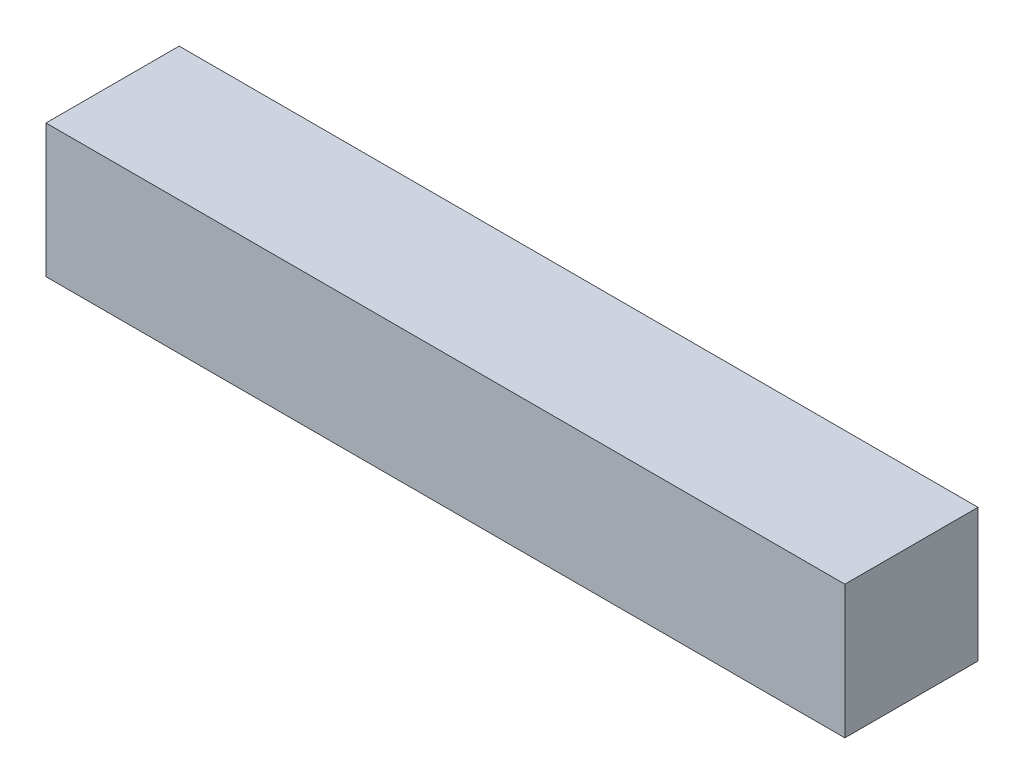
ISO-10303-21;
HEADER;
FILE_DESCRIPTION(('STEP AP214'),'2;1');
FILE_NAME('part.step','',(''),(''),'','','');
FILE_SCHEMA(('AUTOMOTIVE_DESIGN { 1 0 10303 214 1 1 1 1 }'));
ENDSEC;
DATA;
#1=APPLICATION_CONTEXT('core data for automotive mechanical design processes');
#2=APPLICATION_PROTOCOL_DEFINITION('international standard','automotive_design',2000,#1);
#3=PRODUCT_CONTEXT('',#1,'mechanical');
#4=PRODUCT('Part','Part','',(#3));
#5=PRODUCT_RELATED_PRODUCT_CATEGORY('part','',(#4));
#6=PRODUCT_DEFINITION_FORMATION('','',#4);
#7=PRODUCT_DEFINITION_CONTEXT('part definition',#1,'design');
#8=PRODUCT_DEFINITION('design','',#6,#7);
#9=PRODUCT_DEFINITION_SHAPE('','',#8);
#10=(LENGTH_UNIT() NAMED_UNIT(*) SI_UNIT(.MILLI.,.METRE.));
#11=(NAMED_UNIT(*) PLANE_ANGLE_UNIT() SI_UNIT($,.RADIAN.));
#12=(NAMED_UNIT(*) SI_UNIT($,.STERADIAN.) SOLID_ANGLE_UNIT());
#13=UNCERTAINTY_MEASURE_WITH_UNIT(LENGTH_MEASURE(1.E-05),#10,'distance_accuracy_value','');
#14=(GEOMETRIC_REPRESENTATION_CONTEXT(3) GLOBAL_UNCERTAINTY_ASSIGNED_CONTEXT((#13)) GLOBAL_UNIT_ASSIGNED_CONTEXT((#10,
#11,#12)) REPRESENTATION_CONTEXT('',''));
#15=CARTESIAN_POINT('',(0.,0.,0.));
#16=DIRECTION('',(0.,0.,1.));
#17=DIRECTION('',(1.,0.,0.));
#18=AXIS2_PLACEMENT_3D('',#15,#16,#17);
#19=CARTESIAN_POINT('',(152.4,0.,0.));
#20=DIRECTION('',(0.,0.,1.));
#21=DIRECTION('',(0.,-1.,0.));
#22=AXIS2_PLACEMENT_3D('',#19,#20,#21);
#23=PLANE('',#22);
#24=DIRECTION('',(0.,1.,0.));
#25=VECTOR('',#24,1.);
#26=CARTESIAN_POINT('',(0.,0.,0.));
#27=LINE('',#26,#25);
#28=CARTESIAN_POINT('',(0.,0.,0.));
#29=VERTEX_POINT('',#28);
#30=CARTESIAN_POINT('',(0.,25.4,0.));
#31=VERTEX_POINT('',#30);
#32=EDGE_CURVE('E96',#29,#31,#27,.T.);
#33=ORIENTED_EDGE('',*,*,#32,.T.);
#34=DIRECTION('',(-1.,0.,0.));
#35=VECTOR('',#34,1.);
#36=CARTESIAN_POINT('',(152.4,25.4,0.));
#37=LINE('',#36,#35);
#38=CARTESIAN_POINT('',(152.4,25.4,0.));
#39=VERTEX_POINT('',#38);
#40=EDGE_CURVE('E11',#39,#31,#37,.T.);
#41=ORIENTED_EDGE('',*,*,#40,.F.);
#42=DIRECTION('',(0.,1.,0.));
#43=VECTOR('',#42,1.);
#44=CARTESIAN_POINT('',(152.4,0.,0.));
#45=LINE('',#44,#43);
#46=CARTESIAN_POINT('',(152.4,0.,0.));
#47=VERTEX_POINT('',#46);
#48=EDGE_CURVE('E84',#47,#39,#45,.T.);
#49=ORIENTED_EDGE('',*,*,#48,.F.);
#50=DIRECTION('',(-1.,0.,0.));
#51=VECTOR('',#50,1.);
#52=CARTESIAN_POINT('',(152.4,0.,0.));
#53=LINE('',#52,#51);
#54=EDGE_CURVE('E92',#47,#29,#53,.T.);
#55=ORIENTED_EDGE('',*,*,#54,.T.);
#56=EDGE_LOOP('',(#33,#41,#49,#55));
#57=FACE_BOUND('',#56,.T.);
#58=ADVANCED_FACE('F33',(#57),#23,.F.);
#59=CARTESIAN_POINT('',(152.4,25.4,0.));
#60=DIRECTION('',(0.,-1.,0.));
#61=DIRECTION('',(0.,0.,-1.));
#62=AXIS2_PLACEMENT_3D('',#59,#60,#61);
#63=PLANE('',#62);
#64=DIRECTION('',(0.,0.,1.));
#65=VECTOR('',#64,1.);
#66=CARTESIAN_POINT('',(0.,25.4,0.));
#67=LINE('',#66,#65);
#68=CARTESIAN_POINT('',(0.,25.4,25.4));
#69=VERTEX_POINT('',#68);
#70=EDGE_CURVE('E88',#31,#69,#67,.T.);
#71=ORIENTED_EDGE('',*,*,#70,.T.);
#72=DIRECTION('',(-1.,0.,0.));
#73=VECTOR('',#72,1.);
#74=CARTESIAN_POINT('',(152.4,25.4,25.4));
#75=LINE('',#74,#73);
#76=CARTESIAN_POINT('',(152.4,25.4,25.4));
#77=VERTEX_POINT('',#76);
#78=EDGE_CURVE('E41',#77,#69,#75,.T.);
#79=ORIENTED_EDGE('',*,*,#78,.F.);
#80=DIRECTION('',(0.,0.,1.));
#81=VECTOR('',#80,1.);
#82=CARTESIAN_POINT('',(152.4,25.4,0.));
#83=LINE('',#82,#81);
#84=EDGE_CURVE('E79',#39,#77,#83,.T.);
#85=ORIENTED_EDGE('',*,*,#84,.F.);
#86=ORIENTED_EDGE('',*,*,#40,.T.);
#87=EDGE_LOOP('',(#71,#79,#85,#86));
#88=FACE_BOUND('',#87,.T.);
#89=ADVANCED_FACE('F87',(#88),#63,.F.);
#90=CARTESIAN_POINT('',(152.4,0.,25.4));
#91=DIRECTION('',(0.,0.,-1.));
#92=DIRECTION('',(-1.,0.,0.));
#93=AXIS2_PLACEMENT_3D('',#90,#91,#92);
#94=PLANE('',#93);
#95=DIRECTION('',(0.,-1.,0.));
#96=VECTOR('',#95,1.);
#97=CARTESIAN_POINT('',(0.,0.,25.4));
#98=LINE('',#97,#96);
#99=CARTESIAN_POINT('',(0.,0.,25.4));
#100=VERTEX_POINT('',#99);
#101=EDGE_CURVE('E66',#69,#100,#98,.T.);
#102=ORIENTED_EDGE('',*,*,#101,.T.);
#103=DIRECTION('',(-1.,0.,0.));
#104=VECTOR('',#103,1.);
#105=CARTESIAN_POINT('',(152.4,0.,25.4));
#106=LINE('',#105,#104);
#107=CARTESIAN_POINT('',(152.4,0.,25.4));
#108=VERTEX_POINT('',#107);
#109=EDGE_CURVE('E89',#108,#100,#106,.T.);
#110=ORIENTED_EDGE('',*,*,#109,.F.);
#111=DIRECTION('',(0.,-1.,0.));
#112=VECTOR('',#111,1.);
#113=CARTESIAN_POINT('',(152.4,0.,25.4));
#114=LINE('',#113,#112);
#115=EDGE_CURVE('E82',#77,#108,#114,.T.);
#116=ORIENTED_EDGE('',*,*,#115,.F.);
#117=ORIENTED_EDGE('',*,*,#78,.T.);
#118=EDGE_LOOP('',(#102,#110,#116,#117));
#119=FACE_BOUND('',#118,.T.);
#120=ADVANCED_FACE('F90',(#119),#94,.F.);
#121=CARTESIAN_POINT('',(152.4,0.,0.));
#122=DIRECTION('',(0.,1.,0.));
#123=DIRECTION('',(0.,0.,1.));
#124=AXIS2_PLACEMENT_3D('',#121,#122,#123);
#125=PLANE('',#124);
#126=DIRECTION('',(0.,0.,-1.));
#127=VECTOR('',#126,1.);
#128=CARTESIAN_POINT('',(0.,0.,0.));
#129=LINE('',#128,#127);
#130=EDGE_CURVE('E72',#100,#29,#129,.T.);
#131=ORIENTED_EDGE('',*,*,#130,.T.);
#132=ORIENTED_EDGE('',*,*,#54,.F.);
#133=DIRECTION('',(0.,0.,-1.));
#134=VECTOR('',#133,1.);
#135=CARTESIAN_POINT('',(152.4,0.,0.));
#136=LINE('',#135,#134);
#137=EDGE_CURVE('E49',#108,#47,#136,.T.);
#138=ORIENTED_EDGE('',*,*,#137,.F.);
#139=ORIENTED_EDGE('',*,*,#109,.T.);
#140=EDGE_LOOP('',(#131,#132,#138,#139));
#141=FACE_BOUND('',#140,.T.);
#142=ADVANCED_FACE('F103',(#141),#125,.F.);
#143=CARTESIAN_POINT('',(152.4,0.,0.));
#144=DIRECTION('',(1.,0.,0.));
#145=DIRECTION('',(0.,0.,-1.));
#146=AXIS2_PLACEMENT_3D('',#143,#144,#145);
#147=PLANE('',#146);
#148=ORIENTED_EDGE('',*,*,#48,.T.);
#149=ORIENTED_EDGE('',*,*,#84,.T.);
#150=ORIENTED_EDGE('',*,*,#115,.T.);
#151=ORIENTED_EDGE('',*,*,#137,.T.);
#152=EDGE_LOOP('',(#148,#149,#150,#151));
#153=FACE_BOUND('',#152,.T.);
#154=ADVANCED_FACE('F80',(#153),#147,.T.);
#155=CARTESIAN_POINT('',(0.,0.,0.));
#156=DIRECTION('',(1.,0.,0.));
#157=DIRECTION('',(0.,0.,-1.));
#158=AXIS2_PLACEMENT_3D('',#155,#156,#157);
#159=PLANE('',#158);
#160=ORIENTED_EDGE('',*,*,#32,.F.);
#161=ORIENTED_EDGE('',*,*,#130,.F.);
#162=ORIENTED_EDGE('',*,*,#101,.F.);
#163=ORIENTED_EDGE('',*,*,#70,.F.);
#164=EDGE_LOOP('',(#160,#161,#162,#163));
#165=FACE_BOUND('',#164,.T.);
#166=ADVANCED_FACE('F106',(#165),#159,.F.);
#167=CLOSED_SHELL('',(#58,#89,#120,#142,#154,#166));
#168=MANIFOLD_SOLID_BREP('B2',#167);
#169=ADVANCED_BREP_SHAPE_REPRESENTATION('',(#18,#168),#14);
#170=SHAPE_DEFINITION_REPRESENTATION(#9,#169);
ENDSEC;
END-ISO-10303-21;
